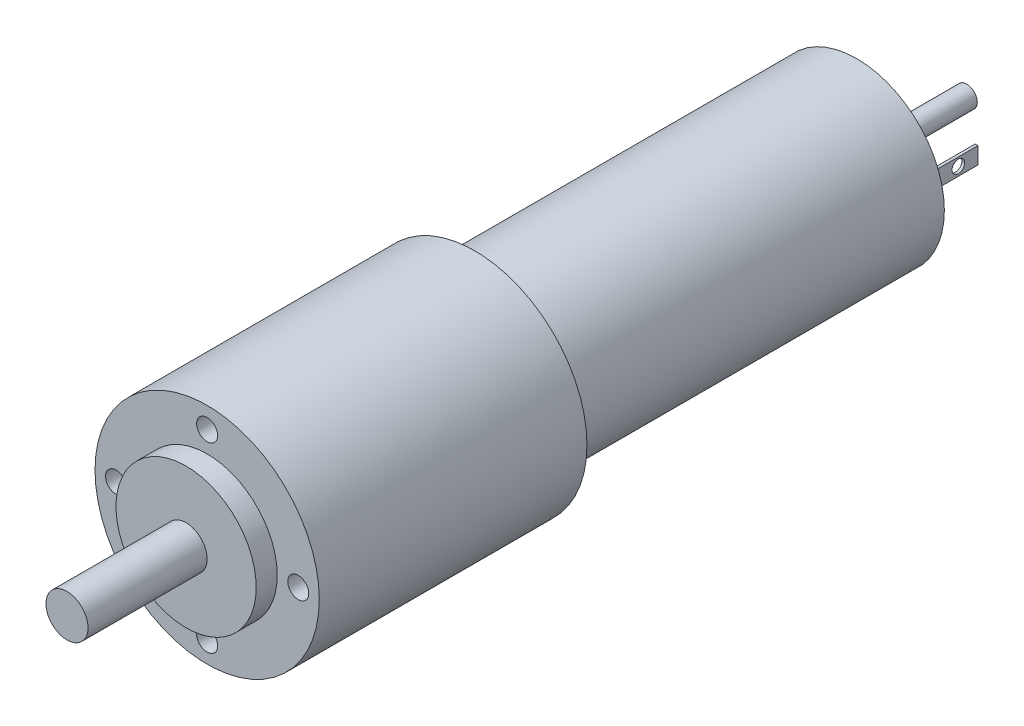
ISO-10303-21;
HEADER;
FILE_DESCRIPTION(('STEP AP214'),'2;1');
FILE_NAME('part.step','',(''),(''),'','','');
FILE_SCHEMA(('AUTOMOTIVE_DESIGN { 1 0 10303 214 1 1 1 1 }'));
ENDSEC;
DATA;
#1=APPLICATION_CONTEXT('core data for automotive mechanical design processes');
#2=APPLICATION_PROTOCOL_DEFINITION('international standard','automotive_design',2000,#1);
#3=PRODUCT_CONTEXT('',#1,'mechanical');
#4=PRODUCT('Part','Part','',(#3));
#5=PRODUCT_RELATED_PRODUCT_CATEGORY('part','',(#4));
#6=PRODUCT_DEFINITION_FORMATION('','',#4);
#7=PRODUCT_DEFINITION_CONTEXT('part definition',#1,'design');
#8=PRODUCT_DEFINITION('design','',#6,#7);
#9=PRODUCT_DEFINITION_SHAPE('','',#8);
#10=(LENGTH_UNIT() NAMED_UNIT(*) SI_UNIT(.MILLI.,.METRE.));
#11=(NAMED_UNIT(*) PLANE_ANGLE_UNIT() SI_UNIT($,.RADIAN.));
#12=(NAMED_UNIT(*) SI_UNIT($,.STERADIAN.) SOLID_ANGLE_UNIT());
#13=UNCERTAINTY_MEASURE_WITH_UNIT(LENGTH_MEASURE(1.E-05),#10,'distance_accuracy_value','');
#14=(GEOMETRIC_REPRESENTATION_CONTEXT(3) GLOBAL_UNCERTAINTY_ASSIGNED_CONTEXT((#13)) GLOBAL_UNIT_ASSIGNED_CONTEXT((#10,
#11,#12)) REPRESENTATION_CONTEXT('',''));
#15=CARTESIAN_POINT('',(0.,0.,0.));
#16=DIRECTION('',(0.,0.,1.));
#17=DIRECTION('',(1.,0.,0.));
#18=AXIS2_PLACEMENT_3D('',#15,#16,#17);
#19=CARTESIAN_POINT('',(0.,0.,-54.5));
#20=DIRECTION('',(0.,0.,-1.));
#21=DIRECTION('',(-1.,0.,0.));
#22=AXIS2_PLACEMENT_3D('',#19,#20,#21);
#23=PLANE('',#22);
#24=CARTESIAN_POINT('',(-4.21084164829086,-7.59655942340246,-54.5));
#25=DIRECTION('',(0.,0.,-1.));
#26=DIRECTION('',(1.,0.,0.));
#27=AXIS2_PLACEMENT_3D('',#24,#25,#26);
#28=CIRCLE('',#27,0.8);
#29=CARTESIAN_POINT('',(-3.41084164829086,-7.59655942340246,-54.5));
#30=VERTEX_POINT('',#29);
#31=EDGE_CURVE('E353',#30,#30,#28,.T.);
#32=ORIENTED_EDGE('',*,*,#31,.F.);
#33=EDGE_LOOP('',(#32));
#34=FACE_BOUND('',#33,.T.);
#35=CARTESIAN_POINT('',(4.21084164829086,7.59655942340246,-54.5));
#36=DIRECTION('',(0.,0.,-1.));
#37=DIRECTION('',(-1.,0.,0.));
#38=AXIS2_PLACEMENT_3D('',#35,#36,#37);
#39=CIRCLE('',#38,0.8);
#40=CARTESIAN_POINT('',(3.41084164829086,7.59655942340246,-54.5));
#41=VERTEX_POINT('',#40);
#42=EDGE_CURVE('E347',#41,#41,#39,.T.);
#43=ORIENTED_EDGE('',*,*,#42,.F.);
#44=EDGE_LOOP('',(#43));
#45=FACE_BOUND('',#44,.T.);
#46=DIRECTION('',(-1.,0.,0.));
#47=VECTOR('',#46,1.);
#48=CARTESIAN_POINT('',(8.6,-0.300000000000008,-54.5));
#49=LINE('',#48,#47);
#50=CARTESIAN_POINT('',(9.,-0.300000000000008,-54.5));
#51=VERTEX_POINT('',#50);
#52=CARTESIAN_POINT('',(8.6,-0.300000000000008,-54.5));
#53=VERTEX_POINT('',#52);
#54=EDGE_CURVE('E148',#51,#53,#49,.T.);
#55=ORIENTED_EDGE('',*,*,#54,.F.);
#56=DIRECTION('',(0.,-1.,0.));
#57=VECTOR('',#56,1.);
#58=CARTESIAN_POINT('',(9.,2.09999999999999,-54.5));
#59=LINE('',#58,#57);
#60=CARTESIAN_POINT('',(9.,2.09999999999999,-54.5));
#61=VERTEX_POINT('',#60);
#62=EDGE_CURVE('E145',#61,#51,#59,.T.);
#63=ORIENTED_EDGE('',*,*,#62,.F.);
#64=DIRECTION('',(1.,0.,0.));
#65=VECTOR('',#64,1.);
#66=CARTESIAN_POINT('',(8.6,2.09999999999999,-54.5));
#67=LINE('',#66,#65);
#68=CARTESIAN_POINT('',(8.6,2.09999999999999,-54.5));
#69=VERTEX_POINT('',#68);
#70=EDGE_CURVE('E138',#69,#61,#67,.T.);
#71=ORIENTED_EDGE('',*,*,#70,.F.);
#72=DIRECTION('',(0.,1.,0.));
#73=VECTOR('',#72,1.);
#74=CARTESIAN_POINT('',(8.6,2.09999999999999,-54.5));
#75=LINE('',#74,#73);
#76=EDGE_CURVE('E150',#53,#69,#75,.T.);
#77=ORIENTED_EDGE('',*,*,#76,.F.);
#78=EDGE_LOOP('',(#55,#63,#71,#77));
#79=FACE_BOUND('',#78,.T.);
#80=CARTESIAN_POINT('',(0.,0.,-54.5));
#81=DIRECTION('',(0.,0.,-1.));
#82=DIRECTION('',(-1.,0.,0.));
#83=AXIS2_PLACEMENT_3D('',#80,#81,#82);
#84=CIRCLE('',#83,12.5);
#85=CARTESIAN_POINT('',(-12.5,0.,-54.5));
#86=VERTEX_POINT('',#85);
#87=EDGE_CURVE('E189',#86,#86,#84,.T.);
#88=ORIENTED_EDGE('',*,*,#87,.T.);
#89=EDGE_LOOP('',(#88));
#90=FACE_BOUND('',#89,.T.);
#91=CARTESIAN_POINT('',(0.,0.,-54.5));
#92=DIRECTION('',(0.,0.,-1.));
#93=DIRECTION('',(-1.,0.,0.));
#94=AXIS2_PLACEMENT_3D('',#91,#92,#93);
#95=CIRCLE('',#94,4.);
#96=CARTESIAN_POINT('',(-4.,0.,-54.5));
#97=VERTEX_POINT('',#96);
#98=EDGE_CURVE('E171',#97,#97,#95,.T.);
#99=ORIENTED_EDGE('',*,*,#98,.F.);
#100=EDGE_LOOP('',(#99));
#101=FACE_BOUND('',#100,.T.);
#102=DIRECTION('',(1.,0.,0.));
#103=VECTOR('',#102,1.);
#104=CARTESIAN_POINT('',(-8.6,0.300000000000008,-54.5));
#105=LINE('',#104,#103);
#106=CARTESIAN_POINT('',(-9.,0.300000000000008,-54.5));
#107=VERTEX_POINT('',#106);
#108=CARTESIAN_POINT('',(-8.6,0.300000000000008,-54.5));
#109=VERTEX_POINT('',#108);
#110=EDGE_CURVE('E331',#107,#109,#105,.T.);
#111=ORIENTED_EDGE('',*,*,#110,.F.);
#112=DIRECTION('',(0.,1.,0.));
#113=VECTOR('',#112,1.);
#114=CARTESIAN_POINT('',(-9.,-2.09999999999999,-54.5));
#115=LINE('',#114,#113);
#116=CARTESIAN_POINT('',(-9.,-2.09999999999999,-54.5));
#117=VERTEX_POINT('',#116);
#118=EDGE_CURVE('E124',#117,#107,#115,.T.);
#119=ORIENTED_EDGE('',*,*,#118,.F.);
#120=DIRECTION('',(-1.,0.,0.));
#121=VECTOR('',#120,1.);
#122=CARTESIAN_POINT('',(-8.6,-2.09999999999999,-54.5));
#123=LINE('',#122,#121);
#124=CARTESIAN_POINT('',(-8.6,-2.09999999999999,-54.5));
#125=VERTEX_POINT('',#124);
#126=EDGE_CURVE('E120',#125,#117,#123,.T.);
#127=ORIENTED_EDGE('',*,*,#126,.F.);
#128=DIRECTION('',(0.,-1.,0.));
#129=VECTOR('',#128,1.);
#130=CARTESIAN_POINT('',(-8.6,-2.09999999999999,-54.5));
#131=LINE('',#130,#129);
#132=EDGE_CURVE('E333',#109,#125,#131,.T.);
#133=ORIENTED_EDGE('',*,*,#132,.F.);
#134=EDGE_LOOP('',(#111,#119,#127,#133));
#135=FACE_BOUND('',#134,.T.);
#136=ADVANCED_FACE('F33',(#34,#45,#79,#90,#101,#135),#23,.T.);
#137=CARTESIAN_POINT('',(0.,0.,-57.2));
#138=DIRECTION('',(0.,0.,-1.));
#139=DIRECTION('',(-1.,0.,0.));
#140=AXIS2_PLACEMENT_3D('',#137,#138,#139);
#141=PLANE('',#140);
#142=CARTESIAN_POINT('',(0.,0.,-57.2));
#143=DIRECTION('',(0.,0.,-1.));
#144=DIRECTION('',(-1.,0.,0.));
#145=AXIS2_PLACEMENT_3D('',#142,#143,#144);
#146=CIRCLE('',#145,3.);
#147=CARTESIAN_POINT('',(-3.,0.,-57.2));
#148=VERTEX_POINT('',#147);
#149=EDGE_CURVE('E168',#148,#148,#146,.T.);
#150=ORIENTED_EDGE('',*,*,#149,.T.);
#151=EDGE_LOOP('',(#150));
#152=FACE_BOUND('',#151,.T.);
#153=CARTESIAN_POINT('',(0.,0.,-57.2));
#154=DIRECTION('',(0.,0.,-1.));
#155=DIRECTION('',(-1.,0.,0.));
#156=AXIS2_PLACEMENT_3D('',#153,#154,#155);
#157=CIRCLE('',#156,1.5);
#158=CARTESIAN_POINT('',(1.5,0.,-57.2));
#159=VERTEX_POINT('',#158);
#160=EDGE_CURVE('E161',#159,#159,#157,.T.);
#161=ORIENTED_EDGE('',*,*,#160,.F.);
#162=EDGE_LOOP('',(#161));
#163=FACE_BOUND('',#162,.T.);
#164=ADVANCED_FACE('F219',(#152,#163),#141,.T.);
#165=CARTESIAN_POINT('',(0.,0.,-55.7));
#166=DIRECTION('',(0.,0.,-1.));
#167=DIRECTION('',(-1.,0.,0.));
#168=AXIS2_PLACEMENT_3D('',#165,#166,#167);
#169=PLANE('',#168);
#170=CARTESIAN_POINT('',(0.,0.,-55.7));
#171=DIRECTION('',(0.,0.,-1.));
#172=DIRECTION('',(-1.,0.,0.));
#173=AXIS2_PLACEMENT_3D('',#170,#171,#172);
#174=CIRCLE('',#173,4.);
#175=CARTESIAN_POINT('',(-4.,0.,-55.7));
#176=VERTEX_POINT('',#175);
#177=EDGE_CURVE('E174',#176,#176,#174,.T.);
#178=ORIENTED_EDGE('',*,*,#177,.T.);
#179=EDGE_LOOP('',(#178));
#180=FACE_BOUND('',#179,.T.);
#181=CARTESIAN_POINT('',(0.,0.,-55.7));
#182=DIRECTION('',(0.,0.,-1.));
#183=DIRECTION('',(-1.,0.,0.));
#184=AXIS2_PLACEMENT_3D('',#181,#182,#183);
#185=CIRCLE('',#184,3.);
#186=CARTESIAN_POINT('',(-3.,0.,-55.7));
#187=VERTEX_POINT('',#186);
#188=EDGE_CURVE('E165',#187,#187,#185,.T.);
#189=ORIENTED_EDGE('',*,*,#188,.F.);
#190=EDGE_LOOP('',(#189));
#191=FACE_BOUND('',#190,.T.);
#192=ADVANCED_FACE('F225',(#180,#191),#169,.T.);
#193=CARTESIAN_POINT('',(0.,0.,41.2));
#194=DIRECTION('',(0.,0.,1.));
#195=DIRECTION('',(1.,0.,0.));
#196=AXIS2_PLACEMENT_3D('',#193,#194,#195);
#197=PLANE('',#196);
#198=CARTESIAN_POINT('',(0.,0.,41.2));
#199=DIRECTION('',(0.,0.,1.));
#200=DIRECTION('',(1.,0.,0.));
#201=AXIS2_PLACEMENT_3D('',#198,#199,#200);
#202=CIRCLE('',#201,10.);
#203=CARTESIAN_POINT('',(10.,0.,41.2));
#204=VERTEX_POINT('',#203);
#205=EDGE_CURVE('E186',#204,#204,#202,.T.);
#206=ORIENTED_EDGE('',*,*,#205,.T.);
#207=EDGE_LOOP('',(#206));
#208=FACE_BOUND('',#207,.T.);
#209=CARTESIAN_POINT('',(0.,0.,41.2));
#210=DIRECTION('',(0.,0.,1.));
#211=DIRECTION('',(1.,0.,0.));
#212=AXIS2_PLACEMENT_3D('',#209,#210,#211);
#213=CIRCLE('',#212,3.);
#214=CARTESIAN_POINT('',(3.,0.,41.2));
#215=VERTEX_POINT('',#214);
#216=EDGE_CURVE('E177',#215,#215,#213,.T.);
#217=ORIENTED_EDGE('',*,*,#216,.F.);
#218=EDGE_LOOP('',(#217));
#219=FACE_BOUND('',#218,.T.);
#220=ADVANCED_FACE('F241',(#208,#219),#197,.T.);
#221=CARTESIAN_POINT('',(0.,0.,38.2));
#222=DIRECTION('',(0.,0.,1.));
#223=DIRECTION('',(1.,0.,0.));
#224=AXIS2_PLACEMENT_3D('',#221,#222,#223);
#225=PLANE('',#224);
#226=CARTESIAN_POINT('',(-1.34575810244374E-13,-13.,38.2));
#227=DIRECTION('',(0.,0.,1.));
#228=DIRECTION('',(0.,1.,0.));
#229=AXIS2_PLACEMENT_3D('',#226,#227,#228);
#230=CIRCLE('',#229,1.5);
#231=CARTESIAN_POINT('',(-1.18864135119382E-13,-11.5,38.2));
#232=VERTEX_POINT('',#231);
#233=EDGE_CURVE('E377',#232,#232,#230,.T.);
#234=ORIENTED_EDGE('',*,*,#233,.F.);
#235=EDGE_LOOP('',(#234));
#236=FACE_BOUND('',#235,.T.);
#237=CARTESIAN_POINT('',(13.,0.,38.2));
#238=DIRECTION('',(0.,0.,1.));
#239=DIRECTION('',(-1.,0.,0.));
#240=AXIS2_PLACEMENT_3D('',#237,#238,#239);
#241=CIRCLE('',#240,1.5);
#242=CARTESIAN_POINT('',(11.5,0.,38.2));
#243=VERTEX_POINT('',#242);
#244=EDGE_CURVE('E371',#243,#243,#241,.T.);
#245=ORIENTED_EDGE('',*,*,#244,.F.);
#246=EDGE_LOOP('',(#245));
#247=FACE_BOUND('',#246,.T.);
#248=CARTESIAN_POINT('',(0.,13.,38.2));
#249=DIRECTION('',(0.,0.,1.));
#250=DIRECTION('',(0.,-1.,0.));
#251=AXIS2_PLACEMENT_3D('',#248,#249,#250);
#252=CIRCLE('',#251,1.5);
#253=CARTESIAN_POINT('',(0.,11.5,38.2));
#254=VERTEX_POINT('',#253);
#255=EDGE_CURVE('E365',#254,#254,#252,.T.);
#256=ORIENTED_EDGE('',*,*,#255,.F.);
#257=EDGE_LOOP('',(#256));
#258=FACE_BOUND('',#257,.T.);
#259=CARTESIAN_POINT('',(-13.,0.,38.2));
#260=DIRECTION('',(0.,0.,1.));
#261=DIRECTION('',(1.,0.,0.));
#262=AXIS2_PLACEMENT_3D('',#259,#260,#261);
#263=CIRCLE('',#262,1.5);
#264=CARTESIAN_POINT('',(-11.5,0.,38.2));
#265=VERTEX_POINT('',#264);
#266=EDGE_CURVE('E359',#265,#265,#263,.T.);
#267=ORIENTED_EDGE('',*,*,#266,.F.);
#268=EDGE_LOOP('',(#267));
#269=FACE_BOUND('',#268,.T.);
#270=CARTESIAN_POINT('',(0.,0.,38.2));
#271=DIRECTION('',(0.,0.,1.));
#272=DIRECTION('',(1.,0.,0.));
#273=AXIS2_PLACEMENT_3D('',#270,#271,#272);
#274=CIRCLE('',#273,16.);
#275=CARTESIAN_POINT('',(16.,0.,38.2));
#276=VERTEX_POINT('',#275);
#277=EDGE_CURVE('E42',#276,#276,#274,.T.);
#278=ORIENTED_EDGE('',*,*,#277,.T.);
#279=EDGE_LOOP('',(#278));
#280=FACE_BOUND('',#279,.T.);
#281=CARTESIAN_POINT('',(0.,0.,38.2));
#282=DIRECTION('',(0.,0.,1.));
#283=DIRECTION('',(1.,0.,0.));
#284=AXIS2_PLACEMENT_3D('',#281,#282,#283);
#285=CIRCLE('',#284,10.);
#286=CARTESIAN_POINT('',(10.,0.,38.2));
#287=VERTEX_POINT('',#286);
#288=EDGE_CURVE('E183',#287,#287,#285,.T.);
#289=ORIENTED_EDGE('',*,*,#288,.F.);
#290=EDGE_LOOP('',(#289));
#291=FACE_BOUND('',#290,.T.);
#292=ADVANCED_FACE('F238',(#236,#247,#258,#269,#280,#291),#225,.T.);
#293=CARTESIAN_POINT('',(0.,0.,0.));
#294=DIRECTION('',(0.,0.,1.));
#295=DIRECTION('',(1.,0.,0.));
#296=AXIS2_PLACEMENT_3D('',#293,#294,#295);
#297=PLANE('',#296);
#298=CARTESIAN_POINT('',(0.,0.,0.));
#299=DIRECTION('',(0.,0.,1.));
#300=DIRECTION('',(1.,0.,0.));
#301=AXIS2_PLACEMENT_3D('',#298,#299,#300);
#302=CIRCLE('',#301,16.);
#303=CARTESIAN_POINT('',(16.,0.,0.));
#304=VERTEX_POINT('',#303);
#305=EDGE_CURVE('E194',#304,#304,#302,.T.);
#306=ORIENTED_EDGE('',*,*,#305,.F.);
#307=EDGE_LOOP('',(#306));
#308=FACE_BOUND('',#307,.T.);
#309=CARTESIAN_POINT('',(0.,0.,0.));
#310=DIRECTION('',(0.,0.,1.));
#311=DIRECTION('',(1.,0.,0.));
#312=AXIS2_PLACEMENT_3D('',#309,#310,#311);
#313=CIRCLE('',#312,12.5);
#314=CARTESIAN_POINT('',(12.5,0.,0.));
#315=VERTEX_POINT('',#314);
#316=EDGE_CURVE('E11',#315,#315,#313,.F.);
#317=ORIENTED_EDGE('',*,*,#316,.F.);
#318=EDGE_LOOP('',(#317));
#319=FACE_BOUND('',#318,.T.);
#320=ADVANCED_FACE('F240',(#308,#319),#297,.F.);
#321=CARTESIAN_POINT('',(0.,0.,38.2));
#322=DIRECTION('',(0.,0.,-1.));
#323=DIRECTION('',(-1.,0.,0.));
#324=AXIS2_PLACEMENT_3D('',#321,#322,#323);
#325=CYLINDRICAL_SURFACE('',#324,16.);
#326=ORIENTED_EDGE('',*,*,#277,.F.);
#327=EDGE_LOOP('',(#326));
#328=FACE_BOUND('',#327,.T.);
#329=ORIENTED_EDGE('',*,*,#305,.T.);
#330=EDGE_LOOP('',(#329));
#331=FACE_BOUND('',#330,.T.);
#332=ADVANCED_FACE('F35',(#328,#331),#325,.T.);
#333=CARTESIAN_POINT('',(0.,0.,-54.5));
#334=DIRECTION('',(0.,0.,1.));
#335=DIRECTION('',(1.,0.,0.));
#336=AXIS2_PLACEMENT_3D('',#333,#334,#335);
#337=CYLINDRICAL_SURFACE('',#336,12.5);
#338=ORIENTED_EDGE('',*,*,#87,.F.);
#339=EDGE_LOOP('',(#338));
#340=FACE_BOUND('',#339,.T.);
#341=ORIENTED_EDGE('',*,*,#316,.T.);
#342=EDGE_LOOP('',(#341));
#343=FACE_BOUND('',#342,.T.);
#344=ADVANCED_FACE('F234',(#340,#343),#337,.T.);
#345=CARTESIAN_POINT('',(0.,0.,41.2));
#346=DIRECTION('',(0.,0.,-1.));
#347=DIRECTION('',(-1.,0.,0.));
#348=AXIS2_PLACEMENT_3D('',#345,#346,#347);
#349=CYLINDRICAL_SURFACE('',#348,10.);
#350=ORIENTED_EDGE('',*,*,#205,.F.);
#351=EDGE_LOOP('',(#350));
#352=FACE_BOUND('',#351,.T.);
#353=ORIENTED_EDGE('',*,*,#288,.T.);
#354=EDGE_LOOP('',(#353));
#355=FACE_BOUND('',#354,.T.);
#356=ADVANCED_FACE('F232',(#352,#355),#349,.T.);
#357=CARTESIAN_POINT('',(0.,0.,58.2));
#358=DIRECTION('',(0.,0.,-1.));
#359=DIRECTION('',(-1.,0.,0.));
#360=AXIS2_PLACEMENT_3D('',#357,#358,#359);
#361=CYLINDRICAL_SURFACE('',#360,3.);
#362=CARTESIAN_POINT('',(0.,0.,58.2));
#363=DIRECTION('',(0.,0.,1.));
#364=DIRECTION('',(1.,0.,0.));
#365=AXIS2_PLACEMENT_3D('',#362,#363,#364);
#366=CIRCLE('',#365,3.);
#367=CARTESIAN_POINT('',(3.,0.,58.2));
#368=VERTEX_POINT('',#367);
#369=EDGE_CURVE('E180',#368,#368,#366,.T.);
#370=ORIENTED_EDGE('',*,*,#369,.F.);
#371=EDGE_LOOP('',(#370));
#372=FACE_BOUND('',#371,.T.);
#373=ORIENTED_EDGE('',*,*,#216,.T.);
#374=EDGE_LOOP('',(#373));
#375=FACE_BOUND('',#374,.T.);
#376=ADVANCED_FACE('F262',(#372,#375),#361,.T.);
#377=CARTESIAN_POINT('',(0.,0.,58.2));
#378=DIRECTION('',(0.,0.,1.));
#379=DIRECTION('',(1.,0.,0.));
#380=AXIS2_PLACEMENT_3D('',#377,#378,#379);
#381=PLANE('',#380);
#382=ORIENTED_EDGE('',*,*,#369,.T.);
#383=EDGE_LOOP('',(#382));
#384=FACE_BOUND('',#383,.T.);
#385=ADVANCED_FACE('F267',(#384),#381,.T.);
#386=CARTESIAN_POINT('',(0.,0.,-55.7));
#387=DIRECTION('',(0.,0.,1.));
#388=DIRECTION('',(1.,0.,0.));
#389=AXIS2_PLACEMENT_3D('',#386,#387,#388);
#390=CYLINDRICAL_SURFACE('',#389,4.);
#391=ORIENTED_EDGE('',*,*,#177,.F.);
#392=EDGE_LOOP('',(#391));
#393=FACE_BOUND('',#392,.T.);
#394=ORIENTED_EDGE('',*,*,#98,.T.);
#395=EDGE_LOOP('',(#394));
#396=FACE_BOUND('',#395,.T.);
#397=ADVANCED_FACE('F284',(#393,#396),#390,.T.);
#398=CARTESIAN_POINT('',(0.,0.,-57.2));
#399=DIRECTION('',(0.,0.,1.));
#400=DIRECTION('',(1.,0.,0.));
#401=AXIS2_PLACEMENT_3D('',#398,#399,#400);
#402=CYLINDRICAL_SURFACE('',#401,3.);
#403=ORIENTED_EDGE('',*,*,#149,.F.);
#404=EDGE_LOOP('',(#403));
#405=FACE_BOUND('',#404,.T.);
#406=ORIENTED_EDGE('',*,*,#188,.T.);
#407=EDGE_LOOP('',(#406));
#408=FACE_BOUND('',#407,.T.);
#409=ADVANCED_FACE('F287',(#405,#408),#402,.T.);
#410=CARTESIAN_POINT('',(0.,0.,-70.2));
#411=DIRECTION('',(0.,0.,1.));
#412=DIRECTION('',(1.,0.,0.));
#413=AXIS2_PLACEMENT_3D('',#410,#411,#412);
#414=CYLINDRICAL_SURFACE('',#413,1.5);
#415=CARTESIAN_POINT('',(0.,0.,-70.2));
#416=DIRECTION('',(0.,0.,-1.));
#417=DIRECTION('',(-1.,0.,0.));
#418=AXIS2_PLACEMENT_3D('',#415,#416,#417);
#419=CIRCLE('',#418,1.5);
#420=CARTESIAN_POINT('',(1.5,0.,-70.2));
#421=VERTEX_POINT('',#420);
#422=EDGE_CURVE('E162',#421,#421,#419,.T.);
#423=CARTESIAN_POINT('',(1.5,0.,-70.2));
#424=CARTESIAN_POINT('',(1.5,0.,-70.0645833333333));
#425=CARTESIAN_POINT('',(1.5,0.,-69.9291666666667));
#426=CARTESIAN_POINT('',(1.5,0.,-69.6583333333333));
#427=CARTESIAN_POINT('',(1.5,0.,-69.5229166666667));
#428=CARTESIAN_POINT('',(1.5,0.,-69.2520833333333));
#429=CARTESIAN_POINT('',(1.5,0.,-69.1166666666667));
#430=CARTESIAN_POINT('',(1.5,0.,-68.8458333333333));
#431=CARTESIAN_POINT('',(1.5,0.,-68.7104166666667));
#432=CARTESIAN_POINT('',(1.5,0.,-68.4395833333333));
#433=CARTESIAN_POINT('',(1.5,0.,-68.3041666666666));
#434=CARTESIAN_POINT('',(1.5,0.,-68.0333333333333));
#435=CARTESIAN_POINT('',(1.5,0.,-67.8979166666667));
#436=CARTESIAN_POINT('',(1.5,0.,-67.6270833333333));
#437=CARTESIAN_POINT('',(1.5,0.,-67.4916666666667));
#438=CARTESIAN_POINT('',(1.5,0.,-67.2208333333333));
#439=CARTESIAN_POINT('',(1.5,0.,-67.0854166666667));
#440=CARTESIAN_POINT('',(1.5,0.,-66.8145833333333));
#441=CARTESIAN_POINT('',(1.5,0.,-66.6791666666667));
#442=CARTESIAN_POINT('',(1.5,0.,-66.4083333333333));
#443=CARTESIAN_POINT('',(1.5,0.,-66.2729166666667));
#444=CARTESIAN_POINT('',(1.5,0.,-66.0020833333333));
#445=CARTESIAN_POINT('',(1.5,0.,-65.8666666666667));
#446=CARTESIAN_POINT('',(1.5,0.,-65.5958333333333));
#447=CARTESIAN_POINT('',(1.5,0.,-65.4604166666667));
#448=CARTESIAN_POINT('',(1.5,0.,-65.1895833333333));
#449=CARTESIAN_POINT('',(1.5,0.,-65.0541666666667));
#450=CARTESIAN_POINT('',(1.5,0.,-64.7833333333333));
#451=CARTESIAN_POINT('',(1.5,0.,-64.6479166666667));
#452=CARTESIAN_POINT('',(1.5,0.,-64.3770833333333));
#453=CARTESIAN_POINT('',(1.5,0.,-64.2416666666667));
#454=CARTESIAN_POINT('',(1.5,0.,-63.9708333333333));
#455=CARTESIAN_POINT('',(1.5,0.,-63.8354166666667));
#456=CARTESIAN_POINT('',(1.5,0.,-63.5645833333333));
#457=CARTESIAN_POINT('',(1.5,0.,-63.4291666666667));
#458=CARTESIAN_POINT('',(1.5,0.,-63.1583333333333));
#459=CARTESIAN_POINT('',(1.5,0.,-63.0229166666667));
#460=CARTESIAN_POINT('',(1.5,0.,-62.7520833333333));
#461=CARTESIAN_POINT('',(1.5,0.,-62.6166666666667));
#462=CARTESIAN_POINT('',(1.5,0.,-62.3458333333333));
#463=CARTESIAN_POINT('',(1.5,0.,-62.2104166666667));
#464=CARTESIAN_POINT('',(1.5,0.,-61.9395833333333));
#465=CARTESIAN_POINT('',(1.5,0.,-61.8041666666667));
#466=CARTESIAN_POINT('',(1.5,0.,-61.5333333333333));
#467=CARTESIAN_POINT('',(1.5,0.,-61.3979166666667));
#468=CARTESIAN_POINT('',(1.5,0.,-61.1270833333333));
#469=CARTESIAN_POINT('',(1.5,0.,-60.9916666666667));
#470=CARTESIAN_POINT('',(1.5,0.,-60.7208333333333));
#471=CARTESIAN_POINT('',(1.5,0.,-60.5854166666667));
#472=CARTESIAN_POINT('',(1.5,0.,-60.3145833333333));
#473=CARTESIAN_POINT('',(1.5,0.,-60.1791666666667));
#474=CARTESIAN_POINT('',(1.5,0.,-59.9083333333333));
#475=CARTESIAN_POINT('',(1.5,0.,-59.7729166666667));
#476=CARTESIAN_POINT('',(1.5,0.,-59.5020833333333));
#477=CARTESIAN_POINT('',(1.5,0.,-59.3666666666667));
#478=CARTESIAN_POINT('',(1.5,0.,-59.0958333333333));
#479=CARTESIAN_POINT('',(1.5,0.,-58.9604166666667));
#480=CARTESIAN_POINT('',(1.5,0.,-58.6895833333333));
#481=CARTESIAN_POINT('',(1.5,0.,-58.5541666666667));
#482=CARTESIAN_POINT('',(1.5,0.,-58.2833333333333));
#483=CARTESIAN_POINT('',(1.5,0.,-58.1479166666667));
#484=CARTESIAN_POINT('',(1.5,0.,-57.8770833333333));
#485=CARTESIAN_POINT('',(1.5,0.,-57.7416666666667));
#486=CARTESIAN_POINT('',(1.5,0.,-57.4708333333333));
#487=CARTESIAN_POINT('',(1.5,0.,-57.3354166666667));
#488=CARTESIAN_POINT('',(1.5,0.,-57.2));
#489=B_SPLINE_CURVE_WITH_KNOTS('',3,(#423,#424,#425,#426,#427,#428,#429,#430,#431,#432,#433,
#434,#435,#436,#437,#438,#439,#440,#441,#442,#443,#444,#445,#446,#447,#448,#449,#450,#451,#452,
#453,#454,#455,#456,#457,#458,#459,#460,#461,#462,#463,#464,#465,#466,#467,#468,#469,#470,#471,
#472,#473,#474,#475,#476,#477,#478,#479,#480,#481,#482,#483,#484,#485,#486,#487,#488),
.UNSPECIFIED.,.F.,.F.,(4,2,2,2,2,2,2,2,2,2,2,2,2,2,2,2,2,2,2,2,2,2,2,2,2,2,2,2,2,2,2,2,4),(0.,
0.406249999999997,0.812499999999994,1.21874999999999,1.62499999999999,2.03125,2.4375,
2.84374999999999,3.24999999999999,3.65624999999999,4.0625,4.46874999999999,4.87499999999999,
5.28124999999999,5.68749999999998,6.09374999999999,6.49999999999999,6.90624999999999,
7.31249999999999,7.71874999999999,8.12499999999999,8.53124999999999,8.93749999999999,
9.34374999999999,9.74999999999999,10.15625,10.5625,10.96875,11.375,11.78125,12.1875,12.59375,
13.),.UNSPECIFIED.);
#490=EDGE_CURVE('BSEAM291',#421,#159,#489,.T.);
#491=ORIENTED_EDGE('',*,*,#422,.F.);
#492=ORIENTED_EDGE('',*,*,#160,.T.);
#493=ORIENTED_EDGE('',*,*,#490,.T.);
#494=ORIENTED_EDGE('',*,*,#490,.F.);
#495=EDGE_LOOP('',(#491,#493,#492,#494));
#496=FACE_BOUND('',#495,.T.);
#497=ADVANCED_FACE('F291',(#496),#414,.T.);
#498=CARTESIAN_POINT('',(0.,0.,-70.2));
#499=DIRECTION('',(0.,0.,-1.));
#500=DIRECTION('',(-1.,0.,0.));
#501=AXIS2_PLACEMENT_3D('',#498,#499,#500);
#502=PLANE('',#501);
#503=ORIENTED_EDGE('',*,*,#422,.T.);
#504=EDGE_LOOP('',(#503));
#505=FACE_BOUND('',#504,.T.);
#506=ADVANCED_FACE('F296',(#505),#502,.T.);
#507=CARTESIAN_POINT('',(9.,2.09999999999999,-62.8));
#508=DIRECTION('',(-1.,0.,0.));
#509=DIRECTION('',(0.,0.,1.));
#510=AXIS2_PLACEMENT_3D('',#507,#508,#509);
#511=PLANE('',#510);
#512=CARTESIAN_POINT('',(9.,0.926162330241453,-59.9979234294779));
#513=DIRECTION('',(1.,0.,0.));
#514=DIRECTION('',(0.,0.,-1.));
#515=AXIS2_PLACEMENT_3D('',#512,#513,#514);
#516=CIRCLE('',#515,0.899999999999997);
#517=CARTESIAN_POINT('',(9.,0.926162330241453,-60.8979234294778));
#518=VERTEX_POINT('',#517);
#519=EDGE_CURVE('E126',#518,#518,#516,.T.);
#520=ORIENTED_EDGE('',*,*,#519,.F.);
#521=EDGE_LOOP('',(#520));
#522=FACE_BOUND('',#521,.T.);
#523=ORIENTED_EDGE('',*,*,#62,.T.);
#524=DIRECTION('',(0.,0.,1.));
#525=VECTOR('',#524,1.);
#526=CARTESIAN_POINT('',(9.,-0.300000000000008,-62.8));
#527=LINE('',#526,#525);
#528=CARTESIAN_POINT('',(9.,-0.300000000000008,-62.8));
#529=VERTEX_POINT('',#528);
#530=EDGE_CURVE('E159',#529,#51,#527,.T.);
#531=ORIENTED_EDGE('',*,*,#530,.F.);
#532=DIRECTION('',(0.,-1.,0.));
#533=VECTOR('',#532,1.);
#534=CARTESIAN_POINT('',(9.,2.09999999999999,-62.8));
#535=LINE('',#534,#533);
#536=CARTESIAN_POINT('',(9.,2.09999999999999,-62.8));
#537=VERTEX_POINT('',#536);
#538=EDGE_CURVE('E134',#537,#529,#535,.T.);
#539=ORIENTED_EDGE('',*,*,#538,.F.);
#540=DIRECTION('',(0.,0.,1.));
#541=VECTOR('',#540,1.);
#542=CARTESIAN_POINT('',(9.,2.09999999999999,-62.8));
#543=LINE('',#542,#541);
#544=EDGE_CURVE('E144',#537,#61,#543,.T.);
#545=ORIENTED_EDGE('',*,*,#544,.T.);
#546=EDGE_LOOP('',(#523,#531,#539,#545));
#547=FACE_BOUND('',#546,.T.);
#548=ADVANCED_FACE('F300',(#522,#547),#511,.F.);
#549=CARTESIAN_POINT('',(8.6,-0.300000000000008,-62.8));
#550=DIRECTION('',(0.,1.,0.));
#551=DIRECTION('',(-1.,0.,0.));
#552=AXIS2_PLACEMENT_3D('',#549,#550,#551);
#553=PLANE('',#552);
#554=ORIENTED_EDGE('',*,*,#54,.T.);
#555=DIRECTION('',(0.,0.,1.));
#556=VECTOR('',#555,1.);
#557=CARTESIAN_POINT('',(8.6,-0.300000000000008,-62.8));
#558=LINE('',#557,#556);
#559=CARTESIAN_POINT('',(8.6,-0.300000000000008,-62.8));
#560=VERTEX_POINT('',#559);
#561=EDGE_CURVE('E156',#560,#53,#558,.T.);
#562=ORIENTED_EDGE('',*,*,#561,.F.);
#563=DIRECTION('',(-1.,0.,0.));
#564=VECTOR('',#563,1.);
#565=CARTESIAN_POINT('',(8.6,-0.300000000000008,-62.8));
#566=LINE('',#565,#564);
#567=EDGE_CURVE('E137',#529,#560,#566,.T.);
#568=ORIENTED_EDGE('',*,*,#567,.F.);
#569=ORIENTED_EDGE('',*,*,#530,.T.);
#570=EDGE_LOOP('',(#554,#562,#568,#569));
#571=FACE_BOUND('',#570,.T.);
#572=ADVANCED_FACE('F304',(#571),#553,.F.);
#573=CARTESIAN_POINT('',(8.6,2.09999999999999,-62.8));
#574=DIRECTION('',(1.,0.,0.));
#575=DIRECTION('',(0.,0.,-1.));
#576=AXIS2_PLACEMENT_3D('',#573,#574,#575);
#577=PLANE('',#576);
#578=CARTESIAN_POINT('',(8.6,0.926162330241453,-59.9979234294779));
#579=DIRECTION('',(1.,0.,0.));
#580=DIRECTION('',(0.,0.,-1.));
#581=AXIS2_PLACEMENT_3D('',#578,#579,#580);
#582=CIRCLE('',#581,0.899999999999997);
#583=CARTESIAN_POINT('',(8.6,0.926162330241453,-60.8979234294778));
#584=VERTEX_POINT('',#583);
#585=EDGE_CURVE('E129',#584,#584,#582,.T.);
#586=ORIENTED_EDGE('',*,*,#585,.T.);
#587=EDGE_LOOP('',(#586));
#588=FACE_BOUND('',#587,.T.);
#589=ORIENTED_EDGE('',*,*,#76,.T.);
#590=DIRECTION('',(0.,0.,1.));
#591=VECTOR('',#590,1.);
#592=CARTESIAN_POINT('',(8.6,2.09999999999999,-62.8));
#593=LINE('',#592,#591);
#594=CARTESIAN_POINT('',(8.6,2.09999999999999,-62.8));
#595=VERTEX_POINT('',#594);
#596=EDGE_CURVE('E58',#595,#69,#593,.T.);
#597=ORIENTED_EDGE('',*,*,#596,.F.);
#598=DIRECTION('',(0.,1.,0.));
#599=VECTOR('',#598,1.);
#600=CARTESIAN_POINT('',(8.6,2.09999999999999,-62.8));
#601=LINE('',#600,#599);
#602=EDGE_CURVE('E140',#560,#595,#601,.T.);
#603=ORIENTED_EDGE('',*,*,#602,.F.);
#604=ORIENTED_EDGE('',*,*,#561,.T.);
#605=EDGE_LOOP('',(#589,#597,#603,#604));
#606=FACE_BOUND('',#605,.T.);
#607=ADVANCED_FACE('F201',(#588,#606),#577,.F.);
#608=CARTESIAN_POINT('',(8.6,2.09999999999999,-62.8));
#609=DIRECTION('',(0.,-1.,0.));
#610=DIRECTION('',(0.,0.,-1.));
#611=AXIS2_PLACEMENT_3D('',#608,#609,#610);
#612=PLANE('',#611);
#613=ORIENTED_EDGE('',*,*,#70,.T.);
#614=ORIENTED_EDGE('',*,*,#544,.F.);
#615=DIRECTION('',(1.,0.,0.));
#616=VECTOR('',#615,1.);
#617=CARTESIAN_POINT('',(8.6,2.09999999999999,-62.8));
#618=LINE('',#617,#616);
#619=EDGE_CURVE('E142',#595,#537,#618,.T.);
#620=ORIENTED_EDGE('',*,*,#619,.F.);
#621=ORIENTED_EDGE('',*,*,#596,.T.);
#622=EDGE_LOOP('',(#613,#614,#620,#621));
#623=FACE_BOUND('',#622,.T.);
#624=ADVANCED_FACE('F215',(#623),#612,.F.);
#625=CARTESIAN_POINT('',(9.,-0.300000000000008,-62.8));
#626=DIRECTION('',(0.,0.,1.));
#627=DIRECTION('',(1.,0.,0.));
#628=AXIS2_PLACEMENT_3D('',#625,#626,#627);
#629=PLANE('',#628);
#630=ORIENTED_EDGE('',*,*,#538,.T.);
#631=ORIENTED_EDGE('',*,*,#567,.T.);
#632=ORIENTED_EDGE('',*,*,#602,.T.);
#633=ORIENTED_EDGE('',*,*,#619,.T.);
#634=EDGE_LOOP('',(#630,#631,#632,#633));
#635=FACE_BOUND('',#634,.T.);
#636=ADVANCED_FACE('F206',(#635),#629,.F.);
#637=CARTESIAN_POINT('',(8.,0.926162330241453,-59.9979234294779));
#638=DIRECTION('',(1.,0.,0.));
#639=DIRECTION('',(0.,0.,-1.));
#640=AXIS2_PLACEMENT_3D('',#637,#638,#639);
#641=CYLINDRICAL_SURFACE('',#640,0.899999999999997);
#642=ORIENTED_EDGE('',*,*,#519,.T.);
#643=EDGE_LOOP('',(#642));
#644=FACE_BOUND('',#643,.T.);
#645=ORIENTED_EDGE('',*,*,#585,.F.);
#646=EDGE_LOOP('',(#645));
#647=FACE_BOUND('',#646,.T.);
#648=ADVANCED_FACE('F204',(#644,#647),#641,.F.);
#649=CARTESIAN_POINT('',(-9.,-2.09999999999999,-62.8));
#650=DIRECTION('',(1.,0.,0.));
#651=DIRECTION('',(0.,0.,-1.));
#652=AXIS2_PLACEMENT_3D('',#649,#650,#651);
#653=PLANE('',#652);
#654=CARTESIAN_POINT('',(-9.,-0.926162330241453,-59.9979234294779));
#655=DIRECTION('',(-1.,0.,0.));
#656=DIRECTION('',(0.,0.,-1.));
#657=AXIS2_PLACEMENT_3D('',#654,#655,#656);
#658=CIRCLE('',#657,0.899999999999997);
#659=CARTESIAN_POINT('',(-9.,-0.926162330241453,-60.8979234294778));
#660=VERTEX_POINT('',#659);
#661=EDGE_CURVE('E343',#660,#660,#658,.T.);
#662=ORIENTED_EDGE('',*,*,#661,.F.);
#663=EDGE_LOOP('',(#662));
#664=FACE_BOUND('',#663,.T.);
#665=ORIENTED_EDGE('',*,*,#118,.T.);
#666=DIRECTION('',(0.,0.,1.));
#667=VECTOR('',#666,1.);
#668=CARTESIAN_POINT('',(-9.,0.300000000000008,-62.8));
#669=LINE('',#668,#667);
#670=CARTESIAN_POINT('',(-9.,0.300000000000008,-62.8));
#671=VERTEX_POINT('',#670);
#672=EDGE_CURVE('E105',#671,#107,#669,.T.);
#673=ORIENTED_EDGE('',*,*,#672,.F.);
#674=DIRECTION('',(0.,1.,0.));
#675=VECTOR('',#674,1.);
#676=CARTESIAN_POINT('',(-9.,-2.09999999999999,-62.8));
#677=LINE('',#676,#675);
#678=CARTESIAN_POINT('',(-9.,-2.09999999999999,-62.8));
#679=VERTEX_POINT('',#678);
#680=EDGE_CURVE('E112',#679,#671,#677,.T.);
#681=ORIENTED_EDGE('',*,*,#680,.F.);
#682=DIRECTION('',(0.,0.,1.));
#683=VECTOR('',#682,1.);
#684=CARTESIAN_POINT('',(-9.,-2.09999999999999,-62.8));
#685=LINE('',#684,#683);
#686=EDGE_CURVE('E340',#679,#117,#685,.T.);
#687=ORIENTED_EDGE('',*,*,#686,.T.);
#688=EDGE_LOOP('',(#665,#673,#681,#687));
#689=FACE_BOUND('',#688,.T.);
#690=ADVANCED_FACE('F122',(#664,#689),#653,.F.);
#691=CARTESIAN_POINT('',(-8.6,0.300000000000008,-62.8));
#692=DIRECTION('',(0.,-1.,0.));
#693=DIRECTION('',(1.,0.,0.));
#694=AXIS2_PLACEMENT_3D('',#691,#692,#693);
#695=PLANE('',#694);
#696=ORIENTED_EDGE('',*,*,#110,.T.);
#697=DIRECTION('',(0.,0.,1.));
#698=VECTOR('',#697,1.);
#699=CARTESIAN_POINT('',(-8.6,0.300000000000008,-62.8));
#700=LINE('',#699,#698);
#701=CARTESIAN_POINT('',(-8.6,0.300000000000008,-62.8));
#702=VERTEX_POINT('',#701);
#703=EDGE_CURVE('E108',#702,#109,#700,.T.);
#704=ORIENTED_EDGE('',*,*,#703,.F.);
#705=DIRECTION('',(1.,0.,0.));
#706=VECTOR('',#705,1.);
#707=CARTESIAN_POINT('',(-8.6,0.300000000000008,-62.8));
#708=LINE('',#707,#706);
#709=EDGE_CURVE('E101',#671,#702,#708,.T.);
#710=ORIENTED_EDGE('',*,*,#709,.F.);
#711=ORIENTED_EDGE('',*,*,#672,.T.);
#712=EDGE_LOOP('',(#696,#704,#710,#711));
#713=FACE_BOUND('',#712,.T.);
#714=ADVANCED_FACE('F103',(#713),#695,.F.);
#715=CARTESIAN_POINT('',(-8.6,-2.09999999999999,-62.8));
#716=DIRECTION('',(-1.,0.,0.));
#717=DIRECTION('',(0.,0.,1.));
#718=AXIS2_PLACEMENT_3D('',#715,#716,#717);
#719=PLANE('',#718);
#720=CARTESIAN_POINT('',(-8.6,-0.926162330241453,-59.9979234294779));
#721=DIRECTION('',(-1.,0.,0.));
#722=DIRECTION('',(0.,0.,1.));
#723=AXIS2_PLACEMENT_3D('',#720,#721,#722);
#724=CIRCLE('',#723,0.899999999999997);
#725=CARTESIAN_POINT('',(-8.6,-0.926162330241453,-59.0979234294779));
#726=VERTEX_POINT('',#725);
#727=EDGE_CURVE('E37',#726,#726,#724,.T.);
#728=ORIENTED_EDGE('',*,*,#727,.T.);
#729=EDGE_LOOP('',(#728));
#730=FACE_BOUND('',#729,.T.);
#731=ORIENTED_EDGE('',*,*,#132,.T.);
#732=DIRECTION('',(0.,0.,1.));
#733=VECTOR('',#732,1.);
#734=CARTESIAN_POINT('',(-8.6,-2.09999999999999,-62.8));
#735=LINE('',#734,#733);
#736=CARTESIAN_POINT('',(-8.6,-2.09999999999999,-62.8));
#737=VERTEX_POINT('',#736);
#738=EDGE_CURVE('E50',#737,#125,#735,.T.);
#739=ORIENTED_EDGE('',*,*,#738,.F.);
#740=DIRECTION('',(0.,-1.,0.));
#741=VECTOR('',#740,1.);
#742=CARTESIAN_POINT('',(-8.6,-2.09999999999999,-62.8));
#743=LINE('',#742,#741);
#744=EDGE_CURVE('E111',#702,#737,#743,.T.);
#745=ORIENTED_EDGE('',*,*,#744,.F.);
#746=ORIENTED_EDGE('',*,*,#703,.T.);
#747=EDGE_LOOP('',(#731,#739,#745,#746));
#748=FACE_BOUND('',#747,.T.);
#749=ADVANCED_FACE('F437',(#730,#748),#719,.F.);
#750=CARTESIAN_POINT('',(-8.6,-2.09999999999999,-62.8));
#751=DIRECTION('',(0.,1.,0.));
#752=DIRECTION('',(0.,0.,1.));
#753=AXIS2_PLACEMENT_3D('',#750,#751,#752);
#754=PLANE('',#753);
#755=ORIENTED_EDGE('',*,*,#126,.T.);
#756=ORIENTED_EDGE('',*,*,#686,.F.);
#757=DIRECTION('',(-1.,0.,0.));
#758=VECTOR('',#757,1.);
#759=CARTESIAN_POINT('',(-8.6,-2.09999999999999,-62.8));
#760=LINE('',#759,#758);
#761=EDGE_CURVE('E116',#737,#679,#760,.T.);
#762=ORIENTED_EDGE('',*,*,#761,.F.);
#763=ORIENTED_EDGE('',*,*,#738,.T.);
#764=EDGE_LOOP('',(#755,#756,#762,#763));
#765=FACE_BOUND('',#764,.T.);
#766=ADVANCED_FACE('F434',(#765),#754,.F.);
#767=CARTESIAN_POINT('',(-9.,0.300000000000008,-62.8));
#768=DIRECTION('',(0.,0.,1.));
#769=DIRECTION('',(-1.,0.,0.));
#770=AXIS2_PLACEMENT_3D('',#767,#768,#769);
#771=PLANE('',#770);
#772=ORIENTED_EDGE('',*,*,#680,.T.);
#773=ORIENTED_EDGE('',*,*,#709,.T.);
#774=ORIENTED_EDGE('',*,*,#744,.T.);
#775=ORIENTED_EDGE('',*,*,#761,.T.);
#776=EDGE_LOOP('',(#772,#773,#774,#775));
#777=FACE_BOUND('',#776,.T.);
#778=ADVANCED_FACE('F115',(#777),#771,.F.);
#779=CARTESIAN_POINT('',(-8.,-0.926162330241453,-59.9979234294779));
#780=DIRECTION('',(-1.,0.,0.));
#781=DIRECTION('',(0.,0.,1.));
#782=AXIS2_PLACEMENT_3D('',#779,#780,#781);
#783=CYLINDRICAL_SURFACE('',#782,0.899999999999997);
#784=ORIENTED_EDGE('',*,*,#661,.T.);
#785=EDGE_LOOP('',(#784));
#786=FACE_BOUND('',#785,.T.);
#787=ORIENTED_EDGE('',*,*,#727,.F.);
#788=EDGE_LOOP('',(#787));
#789=FACE_BOUND('',#788,.T.);
#790=ADVANCED_FACE('F427',(#786,#789),#783,.F.);
#791=CARTESIAN_POINT('',(4.21084164829086,7.59655942340246,-51.5));
#792=DIRECTION('',(0.,0.,-1.));
#793=DIRECTION('',(-1.,0.,0.));
#794=AXIS2_PLACEMENT_3D('',#791,#792,#793);
#795=CYLINDRICAL_SURFACE('',#794,0.8);
#796=CARTESIAN_POINT('',(4.21084164829086,7.59655942340246,-51.5));
#797=DIRECTION('',(0.,0.,-1.));
#798=DIRECTION('',(-1.,0.,0.));
#799=AXIS2_PLACEMENT_3D('',#796,#797,#798);
#800=CIRCLE('',#799,0.8);
#801=CARTESIAN_POINT('',(3.41084164829086,7.59655942340246,-51.5));
#802=VERTEX_POINT('',#801);
#803=EDGE_CURVE('E346',#802,#802,#800,.T.);
#804=ORIENTED_EDGE('',*,*,#803,.F.);
#805=EDGE_LOOP('',(#804));
#806=FACE_BOUND('',#805,.T.);
#807=ORIENTED_EDGE('',*,*,#42,.T.);
#808=EDGE_LOOP('',(#807));
#809=FACE_BOUND('',#808,.T.);
#810=ADVANCED_FACE('F423',(#806,#809),#795,.F.);
#811=CARTESIAN_POINT('',(4.21084164829086,7.59655942340246,-51.5));
#812=DIRECTION('',(0.,0.,-1.));
#813=DIRECTION('',(-1.,0.,0.));
#814=AXIS2_PLACEMENT_3D('',#811,#812,#813);
#815=PLANE('',#814);
#816=ORIENTED_EDGE('',*,*,#803,.T.);
#817=EDGE_LOOP('',(#816));
#818=FACE_BOUND('',#817,.T.);
#819=ADVANCED_FACE('F419',(#818),#815,.T.);
#820=CARTESIAN_POINT('',(-4.21084164829086,-7.59655942340246,-51.5));
#821=DIRECTION('',(0.,0.,-1.));
#822=DIRECTION('',(-1.,0.,0.));
#823=AXIS2_PLACEMENT_3D('',#820,#821,#822);
#824=CYLINDRICAL_SURFACE('',#823,0.8);
#825=CARTESIAN_POINT('',(-4.21084164829086,-7.59655942340246,-51.5));
#826=DIRECTION('',(0.,0.,-1.));
#827=DIRECTION('',(1.,0.,0.));
#828=AXIS2_PLACEMENT_3D('',#825,#826,#827);
#829=CIRCLE('',#828,0.8);
#830=CARTESIAN_POINT('',(-3.41084164829086,-7.59655942340246,-51.5));
#831=VERTEX_POINT('',#830);
#832=EDGE_CURVE('E350',#831,#831,#829,.T.);
#833=ORIENTED_EDGE('',*,*,#832,.F.);
#834=EDGE_LOOP('',(#833));
#835=FACE_BOUND('',#834,.T.);
#836=ORIENTED_EDGE('',*,*,#31,.T.);
#837=EDGE_LOOP('',(#836));
#838=FACE_BOUND('',#837,.T.);
#839=ADVANCED_FACE('F411',(#835,#838),#824,.F.);
#840=CARTESIAN_POINT('',(-4.21084164829086,-7.59655942340246,-51.5));
#841=DIRECTION('',(0.,0.,-1.));
#842=DIRECTION('',(1.,0.,0.));
#843=AXIS2_PLACEMENT_3D('',#840,#841,#842);
#844=PLANE('',#843);
#845=ORIENTED_EDGE('',*,*,#832,.T.);
#846=EDGE_LOOP('',(#845));
#847=FACE_BOUND('',#846,.T.);
#848=ADVANCED_FACE('F401',(#847),#844,.T.);
#849=CARTESIAN_POINT('',(-13.,0.,34.2));
#850=DIRECTION('',(0.,0.,1.));
#851=DIRECTION('',(1.,0.,0.));
#852=AXIS2_PLACEMENT_3D('',#849,#850,#851);
#853=CYLINDRICAL_SURFACE('',#852,1.5);
#854=CARTESIAN_POINT('',(-13.,0.,34.2));
#855=DIRECTION('',(0.,0.,1.));
#856=DIRECTION('',(1.,0.,0.));
#857=AXIS2_PLACEMENT_3D('',#854,#855,#856);
#858=CIRCLE('',#857,1.5);
#859=CARTESIAN_POINT('',(-11.5,0.,34.2));
#860=VERTEX_POINT('',#859);
#861=EDGE_CURVE('E356',#860,#860,#858,.T.);
#862=ORIENTED_EDGE('',*,*,#861,.F.);
#863=EDGE_LOOP('',(#862));
#864=FACE_BOUND('',#863,.T.);
#865=ORIENTED_EDGE('',*,*,#266,.T.);
#866=EDGE_LOOP('',(#865));
#867=FACE_BOUND('',#866,.T.);
#868=ADVANCED_FACE('F398',(#864,#867),#853,.F.);
#869=CARTESIAN_POINT('',(-13.,0.,34.2));
#870=DIRECTION('',(0.,0.,1.));
#871=DIRECTION('',(1.,0.,0.));
#872=AXIS2_PLACEMENT_3D('',#869,#870,#871);
#873=PLANE('',#872);
#874=ORIENTED_EDGE('',*,*,#861,.T.);
#875=EDGE_LOOP('',(#874));
#876=FACE_BOUND('',#875,.T.);
#877=ADVANCED_FACE('F400',(#876),#873,.T.);
#878=CARTESIAN_POINT('',(0.,13.,34.2));
#879=DIRECTION('',(0.,0.,1.));
#880=DIRECTION('',(1.,0.,0.));
#881=AXIS2_PLACEMENT_3D('',#878,#879,#880);
#882=CYLINDRICAL_SURFACE('',#881,1.5);
#883=CARTESIAN_POINT('',(0.,13.,34.2));
#884=DIRECTION('',(0.,0.,1.));
#885=DIRECTION('',(0.,-1.,0.));
#886=AXIS2_PLACEMENT_3D('',#883,#884,#885);
#887=CIRCLE('',#886,1.5);
#888=CARTESIAN_POINT('',(0.,11.5,34.2));
#889=VERTEX_POINT('',#888);
#890=EDGE_CURVE('E362',#889,#889,#887,.T.);
#891=ORIENTED_EDGE('',*,*,#890,.F.);
#892=EDGE_LOOP('',(#891));
#893=FACE_BOUND('',#892,.T.);
#894=ORIENTED_EDGE('',*,*,#255,.T.);
#895=EDGE_LOOP('',(#894));
#896=FACE_BOUND('',#895,.T.);
#897=ADVANCED_FACE('F408',(#893,#896),#882,.F.);
#898=CARTESIAN_POINT('',(0.,13.,34.2));
#899=DIRECTION('',(0.,0.,1.));
#900=DIRECTION('',(0.,-1.,0.));
#901=AXIS2_PLACEMENT_3D('',#898,#899,#900);
#902=PLANE('',#901);
#903=ORIENTED_EDGE('',*,*,#890,.T.);
#904=EDGE_LOOP('',(#903));
#905=FACE_BOUND('',#904,.T.);
#906=ADVANCED_FACE('F508',(#905),#902,.T.);
#907=CARTESIAN_POINT('',(13.,0.,34.2));
#908=DIRECTION('',(0.,0.,1.));
#909=DIRECTION('',(1.,0.,0.));
#910=AXIS2_PLACEMENT_3D('',#907,#908,#909);
#911=CYLINDRICAL_SURFACE('',#910,1.5);
#912=CARTESIAN_POINT('',(13.,0.,34.2));
#913=DIRECTION('',(0.,0.,1.));
#914=DIRECTION('',(-1.,0.,0.));
#915=AXIS2_PLACEMENT_3D('',#912,#913,#914);
#916=CIRCLE('',#915,1.5);
#917=CARTESIAN_POINT('',(11.5,0.,34.2));
#918=VERTEX_POINT('',#917);
#919=EDGE_CURVE('E368',#918,#918,#916,.T.);
#920=ORIENTED_EDGE('',*,*,#919,.F.);
#921=EDGE_LOOP('',(#920));
#922=FACE_BOUND('',#921,.T.);
#923=ORIENTED_EDGE('',*,*,#244,.T.);
#924=EDGE_LOOP('',(#923));
#925=FACE_BOUND('',#924,.T.);
#926=ADVANCED_FACE('F517',(#922,#925),#911,.F.);
#927=CARTESIAN_POINT('',(13.,0.,34.2));
#928=DIRECTION('',(0.,0.,1.));
#929=DIRECTION('',(-1.,0.,0.));
#930=AXIS2_PLACEMENT_3D('',#927,#928,#929);
#931=PLANE('',#930);
#932=ORIENTED_EDGE('',*,*,#919,.T.);
#933=EDGE_LOOP('',(#932));
#934=FACE_BOUND('',#933,.T.);
#935=ADVANCED_FACE('F388',(#934),#931,.T.);
#936=CARTESIAN_POINT('',(-1.34575810244374E-13,-13.,34.2));
#937=DIRECTION('',(0.,0.,1.));
#938=DIRECTION('',(1.,0.,0.));
#939=AXIS2_PLACEMENT_3D('',#936,#937,#938);
#940=CYLINDRICAL_SURFACE('',#939,1.5);
#941=CARTESIAN_POINT('',(-1.34575810244374E-13,-13.,34.2));
#942=DIRECTION('',(0.,0.,1.));
#943=DIRECTION('',(0.,1.,0.));
#944=AXIS2_PLACEMENT_3D('',#941,#942,#943);
#945=CIRCLE('',#944,1.5);
#946=CARTESIAN_POINT('',(-1.18864135119382E-13,-11.5,34.2));
#947=VERTEX_POINT('',#946);
#948=EDGE_CURVE('E374',#947,#947,#945,.T.);
#949=ORIENTED_EDGE('',*,*,#948,.F.);
#950=EDGE_LOOP('',(#949));
#951=FACE_BOUND('',#950,.T.);
#952=ORIENTED_EDGE('',*,*,#233,.T.);
#953=EDGE_LOOP('',(#952));
#954=FACE_BOUND('',#953,.T.);
#955=ADVANCED_FACE('F385',(#951,#954),#940,.F.);
#956=CARTESIAN_POINT('',(-1.34575810244374E-13,-13.,34.2));
#957=DIRECTION('',(0.,0.,1.));
#958=DIRECTION('',(0.,1.,0.));
#959=AXIS2_PLACEMENT_3D('',#956,#957,#958);
#960=PLANE('',#959);
#961=ORIENTED_EDGE('',*,*,#948,.T.);
#962=EDGE_LOOP('',(#961));
#963=FACE_BOUND('',#962,.T.);
#964=ADVANCED_FACE('F383',(#963),#960,.T.);
#965=CLOSED_SHELL('',(#136,#164,#192,#220,#292,#320,#332,#344,#356,#376,#385,#397,#409,#497,
#506,#548,#572,#607,#624,#636,#648,#690,#714,#749,#766,#778,#790,#810,#819,#839,#848,#868,#877,
#897,#906,#926,#935,#955,#964));
#966=MANIFOLD_SOLID_BREP('B2',#965);
#967=ADVANCED_BREP_SHAPE_REPRESENTATION('',(#18,#966),#14);
#968=SHAPE_DEFINITION_REPRESENTATION(#9,#967);
ENDSEC;
END-ISO-10303-21;
